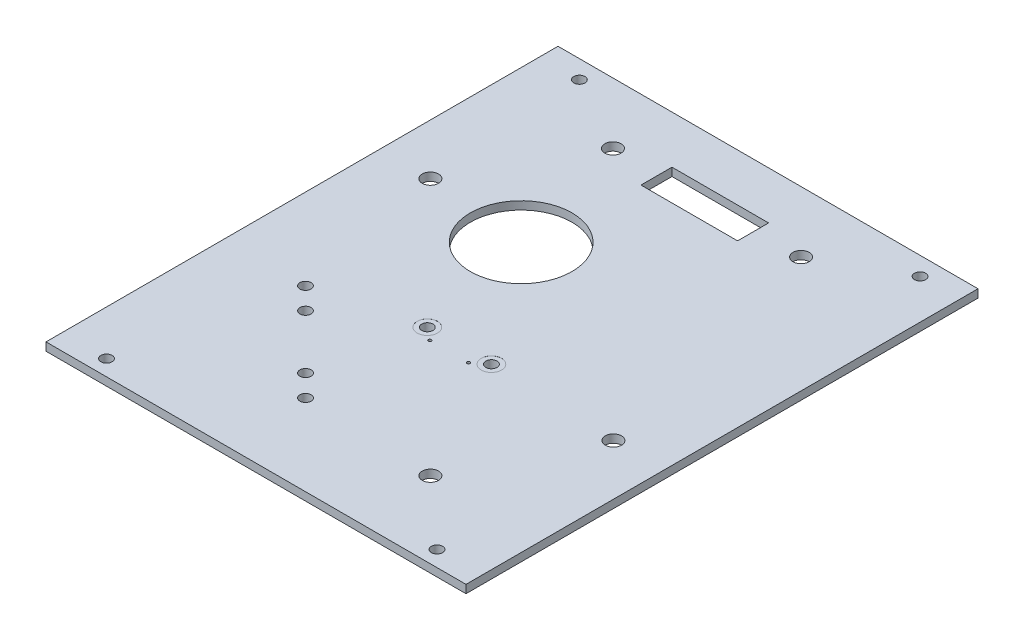
ISO-10303-21;
HEADER;
FILE_DESCRIPTION(('STEP AP214'),'2;1');
FILE_NAME('part.step','',(''),(''),'','','');
FILE_SCHEMA(('AUTOMOTIVE_DESIGN { 1 0 10303 214 1 1 1 1 }'));
ENDSEC;
DATA;
#1=APPLICATION_CONTEXT('core data for automotive mechanical design processes');
#2=APPLICATION_PROTOCOL_DEFINITION('international standard','automotive_design',2000,#1);
#3=PRODUCT_CONTEXT('',#1,'mechanical');
#4=PRODUCT('Part','Part','',(#3));
#5=PRODUCT_RELATED_PRODUCT_CATEGORY('part','',(#4));
#6=PRODUCT_DEFINITION_FORMATION('','',#4);
#7=PRODUCT_DEFINITION_CONTEXT('part definition',#1,'design');
#8=PRODUCT_DEFINITION('design','',#6,#7);
#9=PRODUCT_DEFINITION_SHAPE('','',#8);
#10=(LENGTH_UNIT() NAMED_UNIT(*) SI_UNIT(.MILLI.,.METRE.));
#11=(NAMED_UNIT(*) PLANE_ANGLE_UNIT() SI_UNIT($,.RADIAN.));
#12=(NAMED_UNIT(*) SI_UNIT($,.STERADIAN.) SOLID_ANGLE_UNIT());
#13=UNCERTAINTY_MEASURE_WITH_UNIT(LENGTH_MEASURE(1.E-05),#10,'distance_accuracy_value','');
#14=(GEOMETRIC_REPRESENTATION_CONTEXT(3) GLOBAL_UNCERTAINTY_ASSIGNED_CONTEXT((#13)) GLOBAL_UNIT_ASSIGNED_CONTEXT((#10,
#11,#12)) REPRESENTATION_CONTEXT('',''));
#15=CARTESIAN_POINT('',(0.,0.,0.));
#16=DIRECTION('',(0.,0.,1.));
#17=DIRECTION('',(1.,0.,0.));
#18=AXIS2_PLACEMENT_3D('',#15,#16,#17);
#19=CARTESIAN_POINT('',(17.44,-8.4,29.2374526378947));
#20=DIRECTION('',(0.,1.,0.));
#21=DIRECTION('',(0.,0.,1.));
#22=AXIS2_PLACEMENT_3D('',#19,#20,#21);
#23=CYLINDRICAL_SURFACE('',#22,1.1);
#24=CARTESIAN_POINT('',(17.44,0.,29.2374526378947));
#25=DIRECTION('',(0.,-1.,0.));
#26=DIRECTION('',(0.,0.,-1.));
#27=AXIS2_PLACEMENT_3D('',#24,#25,#26);
#28=CIRCLE('',#27,1.1);
#29=CARTESIAN_POINT('',(17.44,0.,28.1374526378947));
#30=VERTEX_POINT('',#29);
#31=EDGE_CURVE('E209',#30,#30,#28,.T.);
#32=ORIENTED_EDGE('',*,*,#31,.T.);
#33=EDGE_LOOP('',(#32));
#34=FACE_BOUND('',#33,.T.);
#35=CARTESIAN_POINT('',(17.44,1.59,29.2374526378947));
#36=DIRECTION('',(0.,1.,0.));
#37=DIRECTION('',(0.,0.,1.));
#38=AXIS2_PLACEMENT_3D('',#35,#36,#37);
#39=CIRCLE('',#38,1.1);
#40=CARTESIAN_POINT('',(17.44,1.59,30.3374526378947));
#41=VERTEX_POINT('',#40);
#42=EDGE_CURVE('E42',#41,#41,#39,.F.);
#43=ORIENTED_EDGE('',*,*,#42,.F.);
#44=EDGE_LOOP('',(#43));
#45=FACE_BOUND('',#44,.T.);
#46=ADVANCED_FACE('F38',(#34,#45),#23,.F.);
#47=CARTESIAN_POINT('',(30.04,-8.4,29.2374526378947));
#48=DIRECTION('',(0.,1.,0.));
#49=DIRECTION('',(0.,0.,1.));
#50=AXIS2_PLACEMENT_3D('',#47,#48,#49);
#51=CYLINDRICAL_SURFACE('',#50,1.1);
#52=CARTESIAN_POINT('',(30.04,0.,29.2374526378947));
#53=DIRECTION('',(0.,-1.,0.));
#54=DIRECTION('',(0.,0.,-1.));
#55=AXIS2_PLACEMENT_3D('',#52,#53,#54);
#56=CIRCLE('',#55,1.1);
#57=CARTESIAN_POINT('',(30.04,0.,28.1374526378947));
#58=VERTEX_POINT('',#57);
#59=EDGE_CURVE('E212',#58,#58,#56,.T.);
#60=ORIENTED_EDGE('',*,*,#59,.T.);
#61=EDGE_LOOP('',(#60));
#62=FACE_BOUND('',#61,.T.);
#63=CARTESIAN_POINT('',(30.04,1.59,29.2374526378947));
#64=DIRECTION('',(0.,1.,0.));
#65=DIRECTION('',(0.,0.,1.));
#66=AXIS2_PLACEMENT_3D('',#63,#64,#65);
#67=CIRCLE('',#66,1.1);
#68=CARTESIAN_POINT('',(30.04,1.59,30.3374526378947));
#69=VERTEX_POINT('',#68);
#70=EDGE_CURVE('E215',#69,#69,#67,.F.);
#71=ORIENTED_EDGE('',*,*,#70,.F.);
#72=EDGE_LOOP('',(#71));
#73=FACE_BOUND('',#72,.T.);
#74=ADVANCED_FACE('F287',(#62,#73),#51,.F.);
#75=CARTESIAN_POINT('',(0.,1.6,0.));
#76=DIRECTION('',(0.,-1.,0.));
#77=DIRECTION('',(0.,0.,-1.));
#78=AXIS2_PLACEMENT_3D('',#75,#76,#77);
#79=PLANE('',#78);
#80=CARTESIAN_POINT('',(17.5126406871193,1.6,53.270093325014));
#81=DIRECTION('',(0.,-1.,0.));
#82=DIRECTION('',(0.,0.,-1.));
#83=AXIS2_PLACEMENT_3D('',#80,#81,#82);
#84=CIRCLE('',#83,1.09999999999999);
#85=CARTESIAN_POINT('',(17.5126406871193,1.6,52.170093325014));
#86=VERTEX_POINT('',#85);
#87=EDGE_CURVE('E230',#86,#86,#84,.T.);
#88=ORIENTED_EDGE('',*,*,#87,.T.);
#89=EDGE_LOOP('',(#88));
#90=FACE_BOUND('',#89,.T.);
#91=CARTESIAN_POINT('',(13.27,1.6,49.0274526378947));
#92=DIRECTION('',(0.,-1.,0.));
#93=DIRECTION('',(0.,0.,-1.));
#94=AXIS2_PLACEMENT_3D('',#91,#92,#93);
#95=CIRCLE('',#94,1.1);
#96=CARTESIAN_POINT('',(13.27,1.6,47.9274526378947));
#97=VERTEX_POINT('',#96);
#98=EDGE_CURVE('E581',#97,#97,#95,.T.);
#99=ORIENTED_EDGE('',*,*,#98,.T.);
#100=EDGE_LOOP('',(#99));
#101=FACE_BOUND('',#100,.T.);
#102=CARTESIAN_POINT('',(2.66000000000002,1.6,38.4174526378947));
#103=DIRECTION('',(0.,-1.,0.));
#104=DIRECTION('',(0.,0.,-1.));
#105=AXIS2_PLACEMENT_3D('',#102,#103,#104);
#106=CIRCLE('',#105,1.1);
#107=CARTESIAN_POINT('',(2.66000000000002,1.6,37.3174526378947));
#108=VERTEX_POINT('',#107);
#109=EDGE_CURVE('E583',#108,#108,#106,.T.);
#110=ORIENTED_EDGE('',*,*,#109,.T.);
#111=EDGE_LOOP('',(#110));
#112=FACE_BOUND('',#111,.T.);
#113=CARTESIAN_POINT('',(-1.58763496172018,1.6,34.1798121113786));
#114=DIRECTION('',(0.,-1.,0.));
#115=DIRECTION('',(0.,0.,-1.));
#116=AXIS2_PLACEMENT_3D('',#113,#114,#115);
#117=CIRCLE('',#116,1.1);
#118=CARTESIAN_POINT('',(-1.58763496172018,1.6,33.0798121113786));
#119=VERTEX_POINT('',#118);
#120=EDGE_CURVE('E586',#119,#119,#117,.T.);
#121=ORIENTED_EDGE('',*,*,#120,.T.);
#122=EDGE_LOOP('',(#121));
#123=FACE_BOUND('',#122,.T.);
#124=CARTESIAN_POINT('',(30.04,1.6,29.2374526378947));
#125=DIRECTION('',(0.,1.,0.));
#126=DIRECTION('',(0.,0.,1.));
#127=AXIS2_PLACEMENT_3D('',#124,#125,#126);
#128=CIRCLE('',#127,2.);
#129=CARTESIAN_POINT('',(30.04,1.6,31.2374526378947));
#130=VERTEX_POINT('',#129);
#131=EDGE_CURVE('E222',#130,#130,#128,.T.);
#132=ORIENTED_EDGE('',*,*,#131,.F.);
#133=EDGE_LOOP('',(#132));
#134=FACE_BOUND('',#133,.T.);
#135=CARTESIAN_POINT('',(17.44,1.6,29.2374526378947));
#136=DIRECTION('',(0.,1.,0.));
#137=DIRECTION('',(0.,0.,1.));
#138=AXIS2_PLACEMENT_3D('',#135,#136,#137);
#139=CIRCLE('',#138,2.);
#140=CARTESIAN_POINT('',(17.44,1.6,31.2374526378947));
#141=VERTEX_POINT('',#140);
#142=EDGE_CURVE('E235',#141,#141,#139,.T.);
#143=ORIENTED_EDGE('',*,*,#142,.F.);
#144=EDGE_LOOP('',(#143));
#145=FACE_BOUND('',#144,.T.);
#146=CARTESIAN_POINT('',(27.54,1.6,31.2374526378947));
#147=DIRECTION('',(0.,1.,0.));
#148=DIRECTION('',(0.,0.,1.));
#149=AXIS2_PLACEMENT_3D('',#146,#147,#148);
#150=CIRCLE('',#149,0.300000000000001);
#151=CARTESIAN_POINT('',(27.54,1.6,31.5374526378947));
#152=VERTEX_POINT('',#151);
#153=EDGE_CURVE('E205',#152,#152,#150,.T.);
#154=ORIENTED_EDGE('',*,*,#153,.F.);
#155=EDGE_LOOP('',(#154));
#156=FACE_BOUND('',#155,.T.);
#157=CARTESIAN_POINT('',(19.94,1.6,31.2374526378947));
#158=DIRECTION('',(0.,1.,0.));
#159=DIRECTION('',(0.,0.,1.));
#160=AXIS2_PLACEMENT_3D('',#157,#158,#159);
#161=CIRCLE('',#160,0.300000000000001);
#162=CARTESIAN_POINT('',(19.94,1.6,31.5374526378947));
#163=VERTEX_POINT('',#162);
#164=EDGE_CURVE('E214',#163,#163,#161,.T.);
#165=ORIENTED_EDGE('',*,*,#164,.F.);
#166=EDGE_LOOP('',(#165));
#167=FACE_BOUND('',#166,.T.);
#168=CARTESIAN_POINT('',(43.04,1.6,54.2374526378947));
#169=DIRECTION('',(0.,-1.,0.));
#170=DIRECTION('',(0.,0.,-1.));
#171=AXIS2_PLACEMENT_3D('',#168,#169,#170);
#172=CIRCLE('',#171,1.6);
#173=CARTESIAN_POINT('',(43.04,1.6,52.6374526378947));
#174=VERTEX_POINT('',#173);
#175=EDGE_CURVE('E244',#174,#174,#172,.T.);
#176=ORIENTED_EDGE('',*,*,#175,.T.);
#177=EDGE_LOOP('',(#176));
#178=FACE_BOUND('',#177,.T.);
#179=CARTESIAN_POINT('',(5.24000000000003,1.6,-19.4625473621052));
#180=DIRECTION('',(0.,-1.,0.));
#181=DIRECTION('',(0.,0.,-1.));
#182=AXIS2_PLACEMENT_3D('',#179,#180,#181);
#183=CIRCLE('',#182,1.6);
#184=CARTESIAN_POINT('',(5.24000000000003,1.6,-21.0625473621052));
#185=VERTEX_POINT('',#184);
#186=EDGE_CURVE('E250',#185,#185,#183,.T.);
#187=ORIENTED_EDGE('',*,*,#186,.T.);
#188=EDGE_LOOP('',(#187));
#189=FACE_BOUND('',#188,.T.);
#190=CARTESIAN_POINT('',(42.24,1.6,-19.4625473621052));
#191=DIRECTION('',(0.,-1.,0.));
#192=DIRECTION('',(0.,0.,-1.));
#193=AXIS2_PLACEMENT_3D('',#190,#191,#192);
#194=CIRCLE('',#193,1.6);
#195=CARTESIAN_POINT('',(42.24,1.6,-21.0625473621052));
#196=VERTEX_POINT('',#195);
#197=EDGE_CURVE('E256',#196,#196,#194,.T.);
#198=ORIENTED_EDGE('',*,*,#197,.T.);
#199=EDGE_LOOP('',(#198));
#200=FACE_BOUND('',#199,.T.);
#201=CARTESIAN_POINT('',(-7.55999999999997,1.6,3.63745263789472));
#202=DIRECTION('',(0.,-1.,0.));
#203=DIRECTION('',(0.,0.,-1.));
#204=AXIS2_PLACEMENT_3D('',#201,#202,#203);
#205=CIRCLE('',#204,1.60000000000001);
#206=CARTESIAN_POINT('',(-7.55999999999997,1.6,2.03745263789472));
#207=VERTEX_POINT('',#206);
#208=EDGE_CURVE('E262',#207,#207,#205,.T.);
#209=ORIENTED_EDGE('',*,*,#208,.T.);
#210=EDGE_LOOP('',(#209));
#211=FACE_BOUND('',#210,.T.);
#212=CARTESIAN_POINT('',(55.04,1.6,30.2374526378947));
#213=DIRECTION('',(0.,-1.,0.));
#214=DIRECTION('',(0.,0.,-1.));
#215=AXIS2_PLACEMENT_3D('',#212,#213,#214);
#216=CIRCLE('',#215,1.6);
#217=CARTESIAN_POINT('',(55.04,1.6,28.6374526378947));
#218=VERTEX_POINT('',#217);
#219=EDGE_CURVE('E129',#218,#218,#216,.T.);
#220=ORIENTED_EDGE('',*,*,#219,.T.);
#221=EDGE_LOOP('',(#220));
#222=FACE_BOUND('',#221,.T.);
#223=DIRECTION('',(-1.,0.,0.));
#224=VECTOR('',#223,1.);
#225=CARTESIAN_POINT('',(33.24,1.6,-15.9775473621052));
#226=LINE('',#225,#224);
#227=CARTESIAN_POINT('',(33.24,1.6,-15.9775473621052));
#228=VERTEX_POINT('',#227);
#229=CARTESIAN_POINT('',(14.24,1.6,-15.9775473621052));
#230=VERTEX_POINT('',#229);
#231=EDGE_CURVE('E113',#228,#230,#226,.T.);
#232=ORIENTED_EDGE('',*,*,#231,.T.);
#233=DIRECTION('',(0.,0.,-1.));
#234=VECTOR('',#233,1.);
#235=CARTESIAN_POINT('',(14.24,1.6,-15.9775473621052));
#236=LINE('',#235,#234);
#237=CARTESIAN_POINT('',(14.24,1.6,-22.0775473621052));
#238=VERTEX_POINT('',#237);
#239=EDGE_CURVE('E107',#230,#238,#236,.T.);
#240=ORIENTED_EDGE('',*,*,#239,.T.);
#241=DIRECTION('',(1.,0.,0.));
#242=VECTOR('',#241,1.);
#243=CARTESIAN_POINT('',(33.24,1.6,-22.0775473621052));
#244=LINE('',#243,#242);
#245=CARTESIAN_POINT('',(33.24,1.6,-22.0775473621052));
#246=VERTEX_POINT('',#245);
#247=EDGE_CURVE('E116',#238,#246,#244,.T.);
#248=ORIENTED_EDGE('',*,*,#247,.T.);
#249=DIRECTION('',(0.,0.,1.));
#250=VECTOR('',#249,1.);
#251=CARTESIAN_POINT('',(33.24,1.6,-15.9775473621052));
#252=LINE('',#251,#250);
#253=EDGE_CURVE('E55',#246,#228,#252,.T.);
#254=ORIENTED_EDGE('',*,*,#253,.T.);
#255=EDGE_LOOP('',(#232,#240,#248,#254));
#256=FACE_BOUND('',#255,.T.);
#257=CARTESIAN_POINT('',(-8.75999999999998,1.6,66.1374526378947));
#258=DIRECTION('',(0.,1.,0.));
#259=DIRECTION('',(0.,0.,1.));
#260=AXIS2_PLACEMENT_3D('',#257,#258,#259);
#261=CIRCLE('',#260,1.1);
#262=CARTESIAN_POINT('',(-8.75999999999998,1.6,67.2374526378947));
#263=VERTEX_POINT('',#262);
#264=EDGE_CURVE('E163',#263,#263,#261,.T.);
#265=ORIENTED_EDGE('',*,*,#264,.F.);
#266=EDGE_LOOP('',(#265));
#267=FACE_BOUND('',#266,.T.);
#268=CARTESIAN_POINT('',(56.24,1.6,66.1374526378947));
#269=DIRECTION('',(0.,1.,0.));
#270=DIRECTION('',(0.,0.,1.));
#271=AXIS2_PLACEMENT_3D('',#268,#269,#270);
#272=CIRCLE('',#271,1.1);
#273=CARTESIAN_POINT('',(56.24,1.6,67.2374526378947));
#274=VERTEX_POINT('',#273);
#275=EDGE_CURVE('E171',#274,#274,#272,.T.);
#276=ORIENTED_EDGE('',*,*,#275,.F.);
#277=EDGE_LOOP('',(#276));
#278=FACE_BOUND('',#277,.T.);
#279=CARTESIAN_POINT('',(12.19,1.6,5.53745263789474));
#280=DIRECTION('',(0.,-1.,0.));
#281=DIRECTION('',(0.,0.,-1.));
#282=AXIS2_PLACEMENT_3D('',#279,#280,#281);
#283=CIRCLE('',#282,10.);
#284=CARTESIAN_POINT('',(12.19,1.6,-4.46254736210526));
#285=VERTEX_POINT('',#284);
#286=EDGE_CURVE('E188',#285,#285,#283,.T.);
#287=ORIENTED_EDGE('',*,*,#286,.T.);
#288=EDGE_LOOP('',(#287));
#289=FACE_BOUND('',#288,.T.);
#290=CARTESIAN_POINT('',(57.24,1.6,-27.8625473621053));
#291=DIRECTION('',(0.,1.,0.));
#292=DIRECTION('',(0.,0.,1.));
#293=AXIS2_PLACEMENT_3D('',#290,#291,#292);
#294=CIRCLE('',#293,1.1);
#295=CARTESIAN_POINT('',(57.24,1.6,-26.7625473621053));
#296=VERTEX_POINT('',#295);
#297=EDGE_CURVE('E191',#296,#296,#294,.T.);
#298=ORIENTED_EDGE('',*,*,#297,.F.);
#299=EDGE_LOOP('',(#298));
#300=FACE_BOUND('',#299,.T.);
#301=CARTESIAN_POINT('',(-9.75999999999997,1.6,-27.8625473621053));
#302=DIRECTION('',(0.,1.,0.));
#303=DIRECTION('',(0.,0.,1.));
#304=AXIS2_PLACEMENT_3D('',#301,#302,#303);
#305=CIRCLE('',#304,1.1);
#306=CARTESIAN_POINT('',(-9.75999999999997,1.6,-26.7625473621053));
#307=VERTEX_POINT('',#306);
#308=EDGE_CURVE('E47',#307,#307,#305,.T.);
#309=ORIENTED_EDGE('',*,*,#308,.F.);
#310=EDGE_LOOP('',(#309));
#311=FACE_BOUND('',#310,.T.);
#312=DIRECTION('',(1.,0.,0.));
#313=VECTOR('',#312,1.);
#314=CARTESIAN_POINT('',(-17.76,1.6,-31.4625473621053));
#315=LINE('',#314,#313);
#316=CARTESIAN_POINT('',(-17.56,1.6,-31.4625473621053));
#317=VERTEX_POINT('',#316);
#318=CARTESIAN_POINT('',(65.04,1.6,-31.4625473621052));
#319=VERTEX_POINT('',#318);
#320=EDGE_CURVE('E182',#317,#319,#315,.T.);
#321=ORIENTED_EDGE('',*,*,#320,.F.);
#322=DIRECTION('',(0.,0.,1.));
#323=VECTOR('',#322,1.);
#324=CARTESIAN_POINT('',(-17.56,1.6,69.2374526378947));
#325=LINE('',#324,#323);
#326=CARTESIAN_POINT('',(-17.56,1.6,69.2374526378947));
#327=VERTEX_POINT('',#326);
#328=EDGE_CURVE('E145',#317,#327,#325,.T.);
#329=ORIENTED_EDGE('',*,*,#328,.T.);
#330=DIRECTION('',(-1.,0.,0.));
#331=VECTOR('',#330,1.);
#332=CARTESIAN_POINT('',(65.24,1.6,69.2374526378947));
#333=LINE('',#332,#331);
#334=CARTESIAN_POINT('',(65.04,1.6,69.2374526378947));
#335=VERTEX_POINT('',#334);
#336=EDGE_CURVE('E177',#335,#327,#333,.T.);
#337=ORIENTED_EDGE('',*,*,#336,.F.);
#338=DIRECTION('',(0.,0.,-1.));
#339=VECTOR('',#338,1.);
#340=CARTESIAN_POINT('',(65.04,1.6,-31.4625473621052));
#341=LINE('',#340,#339);
#342=EDGE_CURVE('E155',#335,#319,#341,.T.);
#343=ORIENTED_EDGE('',*,*,#342,.T.);
#344=EDGE_LOOP('',(#321,#329,#337,#343));
#345=FACE_BOUND('',#344,.T.);
#346=ADVANCED_FACE('F120',(#90,#101,#112,#123,#134,#145,#156,#167,#178,#189,#200,#211,#222,#256,
#267,#278,#289,#300,#311,#345),#79,.F.);
#347=CARTESIAN_POINT('',(0.,0.,0.));
#348=DIRECTION('',(0.,-1.,0.));
#349=DIRECTION('',(0.,0.,-1.));
#350=AXIS2_PLACEMENT_3D('',#347,#348,#349);
#351=PLANE('',#350);
#352=CARTESIAN_POINT('',(17.5126406871193,0.,53.270093325014));
#353=DIRECTION('',(0.,-1.,0.));
#354=DIRECTION('',(0.,0.,-1.));
#355=AXIS2_PLACEMENT_3D('',#352,#353,#354);
#356=CIRCLE('',#355,1.09999999999999);
#357=CARTESIAN_POINT('',(17.5126406871193,0.,52.170093325014));
#358=VERTEX_POINT('',#357);
#359=EDGE_CURVE('E579',#358,#358,#356,.T.);
#360=ORIENTED_EDGE('',*,*,#359,.F.);
#361=EDGE_LOOP('',(#360));
#362=FACE_BOUND('',#361,.T.);
#363=CARTESIAN_POINT('',(13.27,0.,49.0274526378947));
#364=DIRECTION('',(0.,-1.,0.));
#365=DIRECTION('',(0.,0.,-1.));
#366=AXIS2_PLACEMENT_3D('',#363,#364,#365);
#367=CIRCLE('',#366,1.1);
#368=CARTESIAN_POINT('',(13.27,0.,47.9274526378947));
#369=VERTEX_POINT('',#368);
#370=EDGE_CURVE('E597',#369,#369,#367,.T.);
#371=ORIENTED_EDGE('',*,*,#370,.F.);
#372=EDGE_LOOP('',(#371));
#373=FACE_BOUND('',#372,.T.);
#374=CARTESIAN_POINT('',(2.66000000000002,0.,38.4174526378947));
#375=DIRECTION('',(0.,-1.,0.));
#376=DIRECTION('',(0.,0.,-1.));
#377=AXIS2_PLACEMENT_3D('',#374,#375,#376);
#378=CIRCLE('',#377,1.1);
#379=CARTESIAN_POINT('',(2.66000000000002,0.,37.3174526378947));
#380=VERTEX_POINT('',#379);
#381=EDGE_CURVE('E594',#380,#380,#378,.T.);
#382=ORIENTED_EDGE('',*,*,#381,.F.);
#383=EDGE_LOOP('',(#382));
#384=FACE_BOUND('',#383,.T.);
#385=CARTESIAN_POINT('',(-1.58763496172018,0.,34.1798121113786));
#386=DIRECTION('',(0.,-1.,0.));
#387=DIRECTION('',(0.,0.,-1.));
#388=AXIS2_PLACEMENT_3D('',#385,#386,#387);
#389=CIRCLE('',#388,1.1);
#390=CARTESIAN_POINT('',(-1.58763496172018,0.,33.0798121113786));
#391=VERTEX_POINT('',#390);
#392=EDGE_CURVE('E591',#391,#391,#389,.T.);
#393=ORIENTED_EDGE('',*,*,#392,.F.);
#394=EDGE_LOOP('',(#393));
#395=FACE_BOUND('',#394,.T.);
#396=ORIENTED_EDGE('',*,*,#59,.F.);
#397=EDGE_LOOP('',(#396));
#398=FACE_BOUND('',#397,.T.);
#399=ORIENTED_EDGE('',*,*,#31,.F.);
#400=EDGE_LOOP('',(#399));
#401=FACE_BOUND('',#400,.T.);
#402=CARTESIAN_POINT('',(27.54,0.,31.2374526378947));
#403=DIRECTION('',(0.,-1.,0.));
#404=DIRECTION('',(0.,0.,-1.));
#405=AXIS2_PLACEMENT_3D('',#402,#403,#404);
#406=CIRCLE('',#405,0.300000000000001);
#407=CARTESIAN_POINT('',(27.54,0.,30.9374526378947));
#408=VERTEX_POINT('',#407);
#409=EDGE_CURVE('E204',#408,#408,#406,.T.);
#410=ORIENTED_EDGE('',*,*,#409,.F.);
#411=EDGE_LOOP('',(#410));
#412=FACE_BOUND('',#411,.T.);
#413=CARTESIAN_POINT('',(19.94,0.,31.2374526378947));
#414=DIRECTION('',(0.,-1.,0.));
#415=DIRECTION('',(0.,0.,-1.));
#416=AXIS2_PLACEMENT_3D('',#413,#414,#415);
#417=CIRCLE('',#416,0.300000000000001);
#418=CARTESIAN_POINT('',(19.94,0.,30.9374526378947));
#419=VERTEX_POINT('',#418);
#420=EDGE_CURVE('E201',#419,#419,#417,.T.);
#421=ORIENTED_EDGE('',*,*,#420,.F.);
#422=EDGE_LOOP('',(#421));
#423=FACE_BOUND('',#422,.T.);
#424=CARTESIAN_POINT('',(43.04,0.,54.2374526378947));
#425=DIRECTION('',(0.,-1.,0.));
#426=DIRECTION('',(0.,0.,-1.));
#427=AXIS2_PLACEMENT_3D('',#424,#425,#426);
#428=CIRCLE('',#427,1.6);
#429=CARTESIAN_POINT('',(43.04,0.,52.6374526378947));
#430=VERTEX_POINT('',#429);
#431=EDGE_CURVE('E208',#430,#430,#428,.T.);
#432=ORIENTED_EDGE('',*,*,#431,.F.);
#433=EDGE_LOOP('',(#432));
#434=FACE_BOUND('',#433,.T.);
#435=CARTESIAN_POINT('',(5.24000000000003,0.,-19.4625473621052));
#436=DIRECTION('',(0.,-1.,0.));
#437=DIRECTION('',(0.,0.,-1.));
#438=AXIS2_PLACEMENT_3D('',#435,#436,#437);
#439=CIRCLE('',#438,1.6);
#440=CARTESIAN_POINT('',(5.24000000000003,0.,-21.0625473621052));
#441=VERTEX_POINT('',#440);
#442=EDGE_CURVE('E247',#441,#441,#439,.T.);
#443=ORIENTED_EDGE('',*,*,#442,.F.);
#444=EDGE_LOOP('',(#443));
#445=FACE_BOUND('',#444,.T.);
#446=CARTESIAN_POINT('',(42.24,0.,-19.4625473621052));
#447=DIRECTION('',(0.,-1.,0.));
#448=DIRECTION('',(0.,0.,-1.));
#449=AXIS2_PLACEMENT_3D('',#446,#447,#448);
#450=CIRCLE('',#449,1.6);
#451=CARTESIAN_POINT('',(42.24,0.,-21.0625473621052));
#452=VERTEX_POINT('',#451);
#453=EDGE_CURVE('E253',#452,#452,#450,.T.);
#454=ORIENTED_EDGE('',*,*,#453,.F.);
#455=EDGE_LOOP('',(#454));
#456=FACE_BOUND('',#455,.T.);
#457=CARTESIAN_POINT('',(-7.55999999999997,0.,3.63745263789472));
#458=DIRECTION('',(0.,-1.,0.));
#459=DIRECTION('',(0.,0.,-1.));
#460=AXIS2_PLACEMENT_3D('',#457,#458,#459);
#461=CIRCLE('',#460,1.60000000000001);
#462=CARTESIAN_POINT('',(-7.55999999999997,0.,2.03745263789472));
#463=VERTEX_POINT('',#462);
#464=EDGE_CURVE('E259',#463,#463,#461,.T.);
#465=ORIENTED_EDGE('',*,*,#464,.F.);
#466=EDGE_LOOP('',(#465));
#467=FACE_BOUND('',#466,.T.);
#468=CARTESIAN_POINT('',(55.04,0.,30.2374526378947));
#469=DIRECTION('',(0.,-1.,0.));
#470=DIRECTION('',(0.,0.,-1.));
#471=AXIS2_PLACEMENT_3D('',#468,#469,#470);
#472=CIRCLE('',#471,1.6);
#473=CARTESIAN_POINT('',(55.04,0.,28.6374526378947));
#474=VERTEX_POINT('',#473);
#475=EDGE_CURVE('E264',#474,#474,#472,.T.);
#476=ORIENTED_EDGE('',*,*,#475,.F.);
#477=EDGE_LOOP('',(#476));
#478=FACE_BOUND('',#477,.T.);
#479=DIRECTION('',(0.,0.,-1.));
#480=VECTOR('',#479,1.);
#481=CARTESIAN_POINT('',(14.24,0.,-15.9775473621052));
#482=LINE('',#481,#480);
#483=CARTESIAN_POINT('',(14.24,0.,-15.9775473621052));
#484=VERTEX_POINT('',#483);
#485=CARTESIAN_POINT('',(14.24,0.,-22.0775473621052));
#486=VERTEX_POINT('',#485);
#487=EDGE_CURVE('E63',#484,#486,#482,.T.);
#488=ORIENTED_EDGE('',*,*,#487,.F.);
#489=DIRECTION('',(-1.,0.,0.));
#490=VECTOR('',#489,1.);
#491=CARTESIAN_POINT('',(33.24,0.,-15.9775473621052));
#492=LINE('',#491,#490);
#493=CARTESIAN_POINT('',(33.24,0.,-15.9775473621052));
#494=VERTEX_POINT('',#493);
#495=EDGE_CURVE('E123',#494,#484,#492,.T.);
#496=ORIENTED_EDGE('',*,*,#495,.F.);
#497=DIRECTION('',(0.,0.,1.));
#498=VECTOR('',#497,1.);
#499=CARTESIAN_POINT('',(33.24,0.,-15.9775473621052));
#500=LINE('',#499,#498);
#501=CARTESIAN_POINT('',(33.24,0.,-22.0775473621052));
#502=VERTEX_POINT('',#501);
#503=EDGE_CURVE('E126',#502,#494,#500,.T.);
#504=ORIENTED_EDGE('',*,*,#503,.F.);
#505=DIRECTION('',(1.,0.,0.));
#506=VECTOR('',#505,1.);
#507=CARTESIAN_POINT('',(33.24,0.,-22.0775473621052));
#508=LINE('',#507,#506);
#509=EDGE_CURVE('E135',#486,#502,#508,.T.);
#510=ORIENTED_EDGE('',*,*,#509,.F.);
#511=EDGE_LOOP('',(#488,#496,#504,#510));
#512=FACE_BOUND('',#511,.T.);
#513=DIRECTION('',(0.,0.,1.));
#514=VECTOR('',#513,1.);
#515=CARTESIAN_POINT('',(-17.56,0.,69.2374526378947));
#516=LINE('',#515,#514);
#517=CARTESIAN_POINT('',(-17.56,0.,-31.4625473621053));
#518=VERTEX_POINT('',#517);
#519=CARTESIAN_POINT('',(-17.56,0.,69.2374526378947));
#520=VERTEX_POINT('',#519);
#521=EDGE_CURVE('E141',#518,#520,#516,.T.);
#522=ORIENTED_EDGE('',*,*,#521,.F.);
#523=DIRECTION('',(-1.,0.,0.));
#524=VECTOR('',#523,1.);
#525=CARTESIAN_POINT('',(-17.76,0.,-31.4625473621053));
#526=LINE('',#525,#524);
#527=CARTESIAN_POINT('',(65.04,0.,-31.4625473621052));
#528=VERTEX_POINT('',#527);
#529=EDGE_CURVE('E184',#528,#518,#526,.T.);
#530=ORIENTED_EDGE('',*,*,#529,.F.);
#531=DIRECTION('',(0.,0.,-1.));
#532=VECTOR('',#531,1.);
#533=CARTESIAN_POINT('',(65.04,0.,-31.4625473621052));
#534=LINE('',#533,#532);
#535=CARTESIAN_POINT('',(65.04,0.,69.2374526378947));
#536=VERTEX_POINT('',#535);
#537=EDGE_CURVE('E153',#536,#528,#534,.T.);
#538=ORIENTED_EDGE('',*,*,#537,.F.);
#539=DIRECTION('',(1.,0.,0.));
#540=VECTOR('',#539,1.);
#541=CARTESIAN_POINT('',(65.24,0.,69.2374526378947));
#542=LINE('',#541,#540);
#543=EDGE_CURVE('E180',#520,#536,#542,.T.);
#544=ORIENTED_EDGE('',*,*,#543,.F.);
#545=EDGE_LOOP('',(#522,#530,#538,#544));
#546=FACE_BOUND('',#545,.T.);
#547=CARTESIAN_POINT('',(-8.75999999999998,0.,66.1374526378947));
#548=DIRECTION('',(0.,1.,0.));
#549=DIRECTION('',(0.,0.,1.));
#550=AXIS2_PLACEMENT_3D('',#547,#548,#549);
#551=CIRCLE('',#550,1.1);
#552=CARTESIAN_POINT('',(-8.75999999999998,0.,67.2374526378947));
#553=VERTEX_POINT('',#552);
#554=EDGE_CURVE('E168',#553,#553,#551,.T.);
#555=ORIENTED_EDGE('',*,*,#554,.T.);
#556=EDGE_LOOP('',(#555));
#557=FACE_BOUND('',#556,.T.);
#558=CARTESIAN_POINT('',(56.24,0.,66.1374526378947));
#559=DIRECTION('',(0.,1.,0.));
#560=DIRECTION('',(0.,0.,1.));
#561=AXIS2_PLACEMENT_3D('',#558,#559,#560);
#562=CIRCLE('',#561,1.1);
#563=CARTESIAN_POINT('',(56.24,0.,67.2374526378947));
#564=VERTEX_POINT('',#563);
#565=EDGE_CURVE('E174',#564,#564,#562,.T.);
#566=ORIENTED_EDGE('',*,*,#565,.T.);
#567=EDGE_LOOP('',(#566));
#568=FACE_BOUND('',#567,.T.);
#569=CARTESIAN_POINT('',(12.19,0.,5.53745263789474));
#570=DIRECTION('',(0.,-1.,0.));
#571=DIRECTION('',(0.,0.,-1.));
#572=AXIS2_PLACEMENT_3D('',#569,#570,#571);
#573=CIRCLE('',#572,10.);
#574=CARTESIAN_POINT('',(12.19,0.,-4.46254736210526));
#575=VERTEX_POINT('',#574);
#576=EDGE_CURVE('E187',#575,#575,#573,.T.);
#577=ORIENTED_EDGE('',*,*,#576,.F.);
#578=EDGE_LOOP('',(#577));
#579=FACE_BOUND('',#578,.T.);
#580=CARTESIAN_POINT('',(57.24,0.,-27.8625473621053));
#581=DIRECTION('',(0.,-1.,0.));
#582=DIRECTION('',(0.,0.,-1.));
#583=AXIS2_PLACEMENT_3D('',#580,#581,#582);
#584=CIRCLE('',#583,1.1);
#585=CARTESIAN_POINT('',(57.24,0.,-28.9625473621053));
#586=VERTEX_POINT('',#585);
#587=EDGE_CURVE('E196',#586,#586,#584,.T.);
#588=ORIENTED_EDGE('',*,*,#587,.F.);
#589=EDGE_LOOP('',(#588));
#590=FACE_BOUND('',#589,.T.);
#591=CARTESIAN_POINT('',(-9.75999999999997,0.,-27.8625473621053));
#592=DIRECTION('',(0.,-1.,0.));
#593=DIRECTION('',(0.,0.,-1.));
#594=AXIS2_PLACEMENT_3D('',#591,#592,#593);
#595=CIRCLE('',#594,1.1);
#596=CARTESIAN_POINT('',(-9.75999999999997,0.,-28.9625473621053));
#597=VERTEX_POINT('',#596);
#598=EDGE_CURVE('E11',#597,#597,#595,.T.);
#599=ORIENTED_EDGE('',*,*,#598,.F.);
#600=EDGE_LOOP('',(#599));
#601=FACE_BOUND('',#600,.T.);
#602=ADVANCED_FACE('F40',(#362,#373,#384,#395,#398,#401,#412,#423,#434,#445,#456,#467,#478,#512,
#546,#557,#568,#579,#590,#601),#351,.T.);
#603=CARTESIAN_POINT('',(-9.75999999999997,1.6,-27.8625473621053));
#604=DIRECTION('',(0.,1.,0.));
#605=DIRECTION('',(0.,0.,1.));
#606=AXIS2_PLACEMENT_3D('',#603,#604,#605);
#607=CYLINDRICAL_SURFACE('',#606,1.1);
#608=ORIENTED_EDGE('',*,*,#598,.T.);
#609=EDGE_LOOP('',(#608));
#610=FACE_BOUND('',#609,.T.);
#611=ORIENTED_EDGE('',*,*,#308,.T.);
#612=EDGE_LOOP('',(#611));
#613=FACE_BOUND('',#612,.T.);
#614=ADVANCED_FACE('F331',(#610,#613),#607,.F.);
#615=CARTESIAN_POINT('',(57.24,1.6,-27.8625473621053));
#616=DIRECTION('',(0.,1.,0.));
#617=DIRECTION('',(0.,0.,1.));
#618=AXIS2_PLACEMENT_3D('',#615,#616,#617);
#619=CYLINDRICAL_SURFACE('',#618,1.1);
#620=ORIENTED_EDGE('',*,*,#587,.T.);
#621=EDGE_LOOP('',(#620));
#622=FACE_BOUND('',#621,.T.);
#623=ORIENTED_EDGE('',*,*,#297,.T.);
#624=EDGE_LOOP('',(#623));
#625=FACE_BOUND('',#624,.T.);
#626=ADVANCED_FACE('F338',(#622,#625),#619,.F.);
#627=CARTESIAN_POINT('',(12.19,1.6,5.53745263789474));
#628=DIRECTION('',(0.,-1.,0.));
#629=DIRECTION('',(0.,0.,-1.));
#630=AXIS2_PLACEMENT_3D('',#627,#628,#629);
#631=CYLINDRICAL_SURFACE('',#630,10.);
#632=ORIENTED_EDGE('',*,*,#286,.F.);
#633=EDGE_LOOP('',(#632));
#634=FACE_BOUND('',#633,.T.);
#635=ORIENTED_EDGE('',*,*,#576,.T.);
#636=EDGE_LOOP('',(#635));
#637=FACE_BOUND('',#636,.T.);
#638=ADVANCED_FACE('F342',(#634,#637),#631,.F.);
#639=CARTESIAN_POINT('',(0.,0.,-31.4625473621053));
#640=DIRECTION('',(0.,0.,1.));
#641=DIRECTION('',(1.,0.,0.));
#642=AXIS2_PLACEMENT_3D('',#639,#640,#641);
#643=PLANE('',#642);
#644=ORIENTED_EDGE('',*,*,#529,.T.);
#645=DIRECTION('',(0.,-1.,0.));
#646=VECTOR('',#645,1.);
#647=CARTESIAN_POINT('',(-17.56,1.6,-31.4625473621053));
#648=LINE('',#647,#646);
#649=EDGE_CURVE('E148',#317,#518,#648,.T.);
#650=ORIENTED_EDGE('',*,*,#649,.F.);
#651=ORIENTED_EDGE('',*,*,#320,.T.);
#652=DIRECTION('',(0.,-1.,0.));
#653=VECTOR('',#652,1.);
#654=CARTESIAN_POINT('',(65.04,1.6,-31.4625473621052));
#655=LINE('',#654,#653);
#656=EDGE_CURVE('E160',#319,#528,#655,.T.);
#657=ORIENTED_EDGE('',*,*,#656,.T.);
#658=EDGE_LOOP('',(#644,#650,#651,#657));
#659=FACE_BOUND('',#658,.T.);
#660=ADVANCED_FACE('F346',(#659),#643,.F.);
#661=CARTESIAN_POINT('',(0.,0.,69.2374526378947));
#662=DIRECTION('',(0.,0.,-1.));
#663=DIRECTION('',(-1.,0.,0.));
#664=AXIS2_PLACEMENT_3D('',#661,#662,#663);
#665=PLANE('',#664);
#666=ORIENTED_EDGE('',*,*,#336,.T.);
#667=DIRECTION('',(0.,-1.,0.));
#668=VECTOR('',#667,1.);
#669=CARTESIAN_POINT('',(-17.56,1.6,69.2374526378947));
#670=LINE('',#669,#668);
#671=EDGE_CURVE('E150',#327,#520,#670,.T.);
#672=ORIENTED_EDGE('',*,*,#671,.T.);
#673=ORIENTED_EDGE('',*,*,#543,.T.);
#674=DIRECTION('',(0.,-1.,0.));
#675=VECTOR('',#674,1.);
#676=CARTESIAN_POINT('',(65.04,1.6,69.2374526378947));
#677=LINE('',#676,#675);
#678=EDGE_CURVE('E158',#335,#536,#677,.T.);
#679=ORIENTED_EDGE('',*,*,#678,.F.);
#680=EDGE_LOOP('',(#666,#672,#673,#679));
#681=FACE_BOUND('',#680,.T.);
#682=ADVANCED_FACE('F350',(#681),#665,.F.);
#683=CARTESIAN_POINT('',(56.24,1.6,66.1374526378947));
#684=DIRECTION('',(0.,1.,0.));
#685=DIRECTION('',(0.,0.,1.));
#686=AXIS2_PLACEMENT_3D('',#683,#684,#685);
#687=CYLINDRICAL_SURFACE('',#686,1.1);
#688=ORIENTED_EDGE('',*,*,#565,.F.);
#689=EDGE_LOOP('',(#688));
#690=FACE_BOUND('',#689,.T.);
#691=ORIENTED_EDGE('',*,*,#275,.T.);
#692=EDGE_LOOP('',(#691));
#693=FACE_BOUND('',#692,.T.);
#694=ADVANCED_FACE('F354',(#690,#693),#687,.F.);
#695=CARTESIAN_POINT('',(-8.75999999999998,1.6,66.1374526378947));
#696=DIRECTION('',(0.,1.,0.));
#697=DIRECTION('',(0.,0.,1.));
#698=AXIS2_PLACEMENT_3D('',#695,#696,#697);
#699=CYLINDRICAL_SURFACE('',#698,1.1);
#700=ORIENTED_EDGE('',*,*,#554,.F.);
#701=EDGE_LOOP('',(#700));
#702=FACE_BOUND('',#701,.T.);
#703=ORIENTED_EDGE('',*,*,#264,.T.);
#704=EDGE_LOOP('',(#703));
#705=FACE_BOUND('',#704,.T.);
#706=ADVANCED_FACE('F358',(#702,#705),#699,.F.);
#707=CARTESIAN_POINT('',(65.04,1.6,-31.4625473621052));
#708=DIRECTION('',(-1.,0.,0.));
#709=DIRECTION('',(0.,0.,1.));
#710=AXIS2_PLACEMENT_3D('',#707,#708,#709);
#711=PLANE('',#710);
#712=ORIENTED_EDGE('',*,*,#537,.T.);
#713=ORIENTED_EDGE('',*,*,#656,.F.);
#714=ORIENTED_EDGE('',*,*,#342,.F.);
#715=ORIENTED_EDGE('',*,*,#678,.T.);
#716=EDGE_LOOP('',(#712,#713,#714,#715));
#717=FACE_BOUND('',#716,.T.);
#718=ADVANCED_FACE('F362',(#717),#711,.F.);
#719=CARTESIAN_POINT('',(-17.56,1.6,69.2374526378947));
#720=DIRECTION('',(1.,0.,0.));
#721=DIRECTION('',(0.,0.,-1.));
#722=AXIS2_PLACEMENT_3D('',#719,#720,#721);
#723=PLANE('',#722);
#724=ORIENTED_EDGE('',*,*,#521,.T.);
#725=ORIENTED_EDGE('',*,*,#671,.F.);
#726=ORIENTED_EDGE('',*,*,#328,.F.);
#727=ORIENTED_EDGE('',*,*,#649,.T.);
#728=EDGE_LOOP('',(#724,#725,#726,#727));
#729=FACE_BOUND('',#728,.T.);
#730=ADVANCED_FACE('F366',(#729),#723,.F.);
#731=CARTESIAN_POINT('',(14.24,1.6,-15.9775473621052));
#732=DIRECTION('',(-1.,0.,0.));
#733=DIRECTION('',(0.,0.,1.));
#734=AXIS2_PLACEMENT_3D('',#731,#732,#733);
#735=PLANE('',#734);
#736=ORIENTED_EDGE('',*,*,#487,.T.);
#737=DIRECTION('',(0.,-1.,0.));
#738=VECTOR('',#737,1.);
#739=CARTESIAN_POINT('',(14.24,1.6,-22.0775473621052));
#740=LINE('',#739,#738);
#741=EDGE_CURVE('E103',#238,#486,#740,.T.);
#742=ORIENTED_EDGE('',*,*,#741,.F.);
#743=ORIENTED_EDGE('',*,*,#239,.F.);
#744=DIRECTION('',(0.,-1.,0.));
#745=VECTOR('',#744,1.);
#746=CARTESIAN_POINT('',(14.24,1.6,-15.9775473621052));
#747=LINE('',#746,#745);
#748=EDGE_CURVE('E139',#230,#484,#747,.T.);
#749=ORIENTED_EDGE('',*,*,#748,.T.);
#750=EDGE_LOOP('',(#736,#742,#743,#749));
#751=FACE_BOUND('',#750,.T.);
#752=ADVANCED_FACE('F105',(#751),#735,.F.);
#753=CARTESIAN_POINT('',(33.24,1.6,-15.9775473621052));
#754=DIRECTION('',(0.,0.,1.));
#755=DIRECTION('',(1.,0.,0.));
#756=AXIS2_PLACEMENT_3D('',#753,#754,#755);
#757=PLANE('',#756);
#758=ORIENTED_EDGE('',*,*,#495,.T.);
#759=ORIENTED_EDGE('',*,*,#748,.F.);
#760=ORIENTED_EDGE('',*,*,#231,.F.);
#761=DIRECTION('',(0.,-1.,0.));
#762=VECTOR('',#761,1.);
#763=CARTESIAN_POINT('',(33.24,1.6,-15.9775473621052));
#764=LINE('',#763,#762);
#765=EDGE_CURVE('E142',#228,#494,#764,.T.);
#766=ORIENTED_EDGE('',*,*,#765,.T.);
#767=EDGE_LOOP('',(#758,#759,#760,#766));
#768=FACE_BOUND('',#767,.T.);
#769=ADVANCED_FACE('F372',(#768),#757,.F.);
#770=CARTESIAN_POINT('',(33.24,1.6,-15.9775473621052));
#771=DIRECTION('',(1.,0.,0.));
#772=DIRECTION('',(0.,0.,-1.));
#773=AXIS2_PLACEMENT_3D('',#770,#771,#772);
#774=PLANE('',#773);
#775=ORIENTED_EDGE('',*,*,#503,.T.);
#776=ORIENTED_EDGE('',*,*,#765,.F.);
#777=ORIENTED_EDGE('',*,*,#253,.F.);
#778=DIRECTION('',(0.,-1.,0.));
#779=VECTOR('',#778,1.);
#780=CARTESIAN_POINT('',(33.24,1.6,-22.0775473621052));
#781=LINE('',#780,#779);
#782=EDGE_CURVE('E112',#246,#502,#781,.T.);
#783=ORIENTED_EDGE('',*,*,#782,.T.);
#784=EDGE_LOOP('',(#775,#776,#777,#783));
#785=FACE_BOUND('',#784,.T.);
#786=ADVANCED_FACE('F283',(#785),#774,.F.);
#787=CARTESIAN_POINT('',(33.24,1.6,-22.0775473621052));
#788=DIRECTION('',(0.,0.,-1.));
#789=DIRECTION('',(-1.,0.,0.));
#790=AXIS2_PLACEMENT_3D('',#787,#788,#789);
#791=PLANE('',#790);
#792=ORIENTED_EDGE('',*,*,#509,.T.);
#793=ORIENTED_EDGE('',*,*,#782,.F.);
#794=ORIENTED_EDGE('',*,*,#247,.F.);
#795=ORIENTED_EDGE('',*,*,#741,.T.);
#796=EDGE_LOOP('',(#792,#793,#794,#795));
#797=FACE_BOUND('',#796,.T.);
#798=ADVANCED_FACE('F117',(#797),#791,.F.);
#799=CARTESIAN_POINT('',(55.04,10.,30.2374526378947));
#800=DIRECTION('',(0.,-1.,0.));
#801=DIRECTION('',(0.,0.,-1.));
#802=AXIS2_PLACEMENT_3D('',#799,#800,#801);
#803=CYLINDRICAL_SURFACE('',#802,1.6);
#804=ORIENTED_EDGE('',*,*,#475,.T.);
#805=EDGE_LOOP('',(#804));
#806=FACE_BOUND('',#805,.T.);
#807=ORIENTED_EDGE('',*,*,#219,.F.);
#808=EDGE_LOOP('',(#807));
#809=FACE_BOUND('',#808,.T.);
#810=ADVANCED_FACE('F272',(#806,#809),#803,.F.);
#811=CARTESIAN_POINT('',(-7.55999999999997,10.,3.63745263789472));
#812=DIRECTION('',(0.,-1.,0.));
#813=DIRECTION('',(0.,0.,-1.));
#814=AXIS2_PLACEMENT_3D('',#811,#812,#813);
#815=CYLINDRICAL_SURFACE('',#814,1.60000000000001);
#816=ORIENTED_EDGE('',*,*,#464,.T.);
#817=EDGE_LOOP('',(#816));
#818=FACE_BOUND('',#817,.T.);
#819=ORIENTED_EDGE('',*,*,#208,.F.);
#820=EDGE_LOOP('',(#819));
#821=FACE_BOUND('',#820,.T.);
#822=ADVANCED_FACE('F274',(#818,#821),#815,.F.);
#823=CARTESIAN_POINT('',(42.24,10.,-19.4625473621052));
#824=DIRECTION('',(0.,-1.,0.));
#825=DIRECTION('',(0.,0.,-1.));
#826=AXIS2_PLACEMENT_3D('',#823,#824,#825);
#827=CYLINDRICAL_SURFACE('',#826,1.6);
#828=ORIENTED_EDGE('',*,*,#453,.T.);
#829=EDGE_LOOP('',(#828));
#830=FACE_BOUND('',#829,.T.);
#831=ORIENTED_EDGE('',*,*,#197,.F.);
#832=EDGE_LOOP('',(#831));
#833=FACE_BOUND('',#832,.T.);
#834=ADVANCED_FACE('F280',(#830,#833),#827,.F.);
#835=CARTESIAN_POINT('',(5.24000000000003,10.,-19.4625473621052));
#836=DIRECTION('',(0.,-1.,0.));
#837=DIRECTION('',(0.,0.,-1.));
#838=AXIS2_PLACEMENT_3D('',#835,#836,#837);
#839=CYLINDRICAL_SURFACE('',#838,1.6);
#840=ORIENTED_EDGE('',*,*,#442,.T.);
#841=EDGE_LOOP('',(#840));
#842=FACE_BOUND('',#841,.T.);
#843=ORIENTED_EDGE('',*,*,#186,.F.);
#844=EDGE_LOOP('',(#843));
#845=FACE_BOUND('',#844,.T.);
#846=ADVANCED_FACE('F310',(#842,#845),#839,.F.);
#847=CARTESIAN_POINT('',(43.04,10.,54.2374526378947));
#848=DIRECTION('',(0.,-1.,0.));
#849=DIRECTION('',(0.,0.,-1.));
#850=AXIS2_PLACEMENT_3D('',#847,#848,#849);
#851=CYLINDRICAL_SURFACE('',#850,1.6);
#852=ORIENTED_EDGE('',*,*,#431,.T.);
#853=EDGE_LOOP('',(#852));
#854=FACE_BOUND('',#853,.T.);
#855=ORIENTED_EDGE('',*,*,#175,.F.);
#856=EDGE_LOOP('',(#855));
#857=FACE_BOUND('',#856,.T.);
#858=ADVANCED_FACE('F306',(#854,#857),#851,.F.);
#859=CARTESIAN_POINT('',(19.94,-8.4,31.2374526378947));
#860=DIRECTION('',(0.,1.,0.));
#861=DIRECTION('',(0.,0.,1.));
#862=AXIS2_PLACEMENT_3D('',#859,#860,#861);
#863=CYLINDRICAL_SURFACE('',#862,0.300000000000001);
#864=ORIENTED_EDGE('',*,*,#420,.T.);
#865=EDGE_LOOP('',(#864));
#866=FACE_BOUND('',#865,.T.);
#867=ORIENTED_EDGE('',*,*,#164,.T.);
#868=EDGE_LOOP('',(#867));
#869=FACE_BOUND('',#868,.T.);
#870=ADVANCED_FACE('F302',(#866,#869),#863,.F.);
#871=CARTESIAN_POINT('',(27.54,-8.4,31.2374526378947));
#872=DIRECTION('',(0.,1.,0.));
#873=DIRECTION('',(0.,0.,1.));
#874=AXIS2_PLACEMENT_3D('',#871,#872,#873);
#875=CYLINDRICAL_SURFACE('',#874,0.300000000000001);
#876=ORIENTED_EDGE('',*,*,#409,.T.);
#877=EDGE_LOOP('',(#876));
#878=FACE_BOUND('',#877,.T.);
#879=ORIENTED_EDGE('',*,*,#153,.T.);
#880=EDGE_LOOP('',(#879));
#881=FACE_BOUND('',#880,.T.);
#882=ADVANCED_FACE('F298',(#878,#881),#875,.F.);
#883=CARTESIAN_POINT('',(30.04,1.59,29.2374526378947));
#884=DIRECTION('',(0.,1.,0.));
#885=DIRECTION('',(0.,0.,1.));
#886=AXIS2_PLACEMENT_3D('',#883,#884,#885);
#887=PLANE('',#886);
#888=CARTESIAN_POINT('',(30.04,1.59,29.2374526378947));
#889=DIRECTION('',(0.,1.,0.));
#890=DIRECTION('',(0.,0.,1.));
#891=AXIS2_PLACEMENT_3D('',#888,#889,#890);
#892=CIRCLE('',#891,2.);
#893=CARTESIAN_POINT('',(30.04,1.59,31.2374526378947));
#894=VERTEX_POINT('',#893);
#895=EDGE_CURVE('E217',#894,#894,#892,.T.);
#896=ORIENTED_EDGE('',*,*,#895,.T.);
#897=EDGE_LOOP('',(#896));
#898=FACE_BOUND('',#897,.T.);
#899=ORIENTED_EDGE('',*,*,#70,.T.);
#900=EDGE_LOOP('',(#899));
#901=FACE_BOUND('',#900,.T.);
#902=ADVANCED_FACE('F301',(#898,#901),#887,.T.);
#903=CARTESIAN_POINT('',(30.04,1.59,29.2374526378947));
#904=DIRECTION('',(0.,1.,0.));
#905=DIRECTION('',(0.,0.,1.));
#906=AXIS2_PLACEMENT_3D('',#903,#904,#905);
#907=CYLINDRICAL_SURFACE('',#906,2.);
#908=ORIENTED_EDGE('',*,*,#895,.F.);
#909=EDGE_LOOP('',(#908));
#910=FACE_BOUND('',#909,.T.);
#911=ORIENTED_EDGE('',*,*,#131,.T.);
#912=EDGE_LOOP('',(#911));
#913=FACE_BOUND('',#912,.T.);
#914=ADVANCED_FACE('F485',(#910,#913),#907,.F.);
#915=CARTESIAN_POINT('',(17.44,1.59,29.2374526378947));
#916=DIRECTION('',(0.,1.,0.));
#917=DIRECTION('',(0.,0.,1.));
#918=AXIS2_PLACEMENT_3D('',#915,#916,#917);
#919=PLANE('',#918);
#920=CARTESIAN_POINT('',(17.44,1.59,29.2374526378947));
#921=DIRECTION('',(0.,1.,0.));
#922=DIRECTION('',(0.,0.,1.));
#923=AXIS2_PLACEMENT_3D('',#920,#921,#922);
#924=CIRCLE('',#923,2.);
#925=CARTESIAN_POINT('',(17.44,1.59,31.2374526378947));
#926=VERTEX_POINT('',#925);
#927=EDGE_CURVE('E227',#926,#926,#924,.T.);
#928=ORIENTED_EDGE('',*,*,#927,.T.);
#929=EDGE_LOOP('',(#928));
#930=FACE_BOUND('',#929,.T.);
#931=ORIENTED_EDGE('',*,*,#42,.T.);
#932=EDGE_LOOP('',(#931));
#933=FACE_BOUND('',#932,.T.);
#934=ADVANCED_FACE('F496',(#930,#933),#919,.T.);
#935=CARTESIAN_POINT('',(17.44,1.59,29.2374526378947));
#936=DIRECTION('',(0.,1.,0.));
#937=DIRECTION('',(0.,0.,1.));
#938=AXIS2_PLACEMENT_3D('',#935,#936,#937);
#939=CYLINDRICAL_SURFACE('',#938,2.);
#940=ORIENTED_EDGE('',*,*,#927,.F.);
#941=EDGE_LOOP('',(#940));
#942=FACE_BOUND('',#941,.T.);
#943=ORIENTED_EDGE('',*,*,#142,.T.);
#944=EDGE_LOOP('',(#943));
#945=FACE_BOUND('',#944,.T.);
#946=ADVANCED_FACE('F506',(#942,#945),#939,.F.);
#947=CARTESIAN_POINT('',(-1.58763496172018,10.,34.1798121113786));
#948=DIRECTION('',(0.,-1.,0.));
#949=DIRECTION('',(0.,0.,-1.));
#950=AXIS2_PLACEMENT_3D('',#947,#948,#949);
#951=CYLINDRICAL_SURFACE('',#950,1.1);
#952=ORIENTED_EDGE('',*,*,#392,.T.);
#953=EDGE_LOOP('',(#952));
#954=FACE_BOUND('',#953,.T.);
#955=ORIENTED_EDGE('',*,*,#120,.F.);
#956=EDGE_LOOP('',(#955));
#957=FACE_BOUND('',#956,.T.);
#958=ADVANCED_FACE('F516',(#954,#957),#951,.F.);
#959=CARTESIAN_POINT('',(2.66000000000002,10.,38.4174526378947));
#960=DIRECTION('',(0.,-1.,0.));
#961=DIRECTION('',(0.,0.,-1.));
#962=AXIS2_PLACEMENT_3D('',#959,#960,#961);
#963=CYLINDRICAL_SURFACE('',#962,1.1);
#964=ORIENTED_EDGE('',*,*,#381,.T.);
#965=EDGE_LOOP('',(#964));
#966=FACE_BOUND('',#965,.T.);
#967=ORIENTED_EDGE('',*,*,#109,.F.);
#968=EDGE_LOOP('',(#967));
#969=FACE_BOUND('',#968,.T.);
#970=ADVANCED_FACE('F542',(#966,#969),#963,.F.);
#971=CARTESIAN_POINT('',(13.27,10.,49.0274526378947));
#972=DIRECTION('',(0.,-1.,0.));
#973=DIRECTION('',(0.,0.,-1.));
#974=AXIS2_PLACEMENT_3D('',#971,#972,#973);
#975=CYLINDRICAL_SURFACE('',#974,1.1);
#976=ORIENTED_EDGE('',*,*,#370,.T.);
#977=EDGE_LOOP('',(#976));
#978=FACE_BOUND('',#977,.T.);
#979=ORIENTED_EDGE('',*,*,#98,.F.);
#980=EDGE_LOOP('',(#979));
#981=FACE_BOUND('',#980,.T.);
#982=ADVANCED_FACE('F552',(#978,#981),#975,.F.);
#983=CARTESIAN_POINT('',(17.5126406871193,10.,53.270093325014));
#984=DIRECTION('',(0.,-1.,0.));
#985=DIRECTION('',(0.,0.,-1.));
#986=AXIS2_PLACEMENT_3D('',#983,#984,#985);
#987=CYLINDRICAL_SURFACE('',#986,1.09999999999999);
#988=ORIENTED_EDGE('',*,*,#359,.T.);
#989=EDGE_LOOP('',(#988));
#990=FACE_BOUND('',#989,.T.);
#991=ORIENTED_EDGE('',*,*,#87,.F.);
#992=EDGE_LOOP('',(#991));
#993=FACE_BOUND('',#992,.T.);
#994=ADVANCED_FACE('F562',(#990,#993),#987,.F.);
#995=CLOSED_SHELL('',(#46,#74,#346,#602,#614,#626,#638,#660,#682,#694,#706,#718,#730,#752,#769,
#786,#798,#810,#822,#834,#846,#858,#870,#882,#902,#914,#934,#946,#958,#970,#982,#994));
#996=MANIFOLD_SOLID_BREP('B2',#995);
#997=ADVANCED_BREP_SHAPE_REPRESENTATION('',(#18,#996),#14);
#998=SHAPE_DEFINITION_REPRESENTATION(#9,#997);
ENDSEC;
END-ISO-10303-21;
